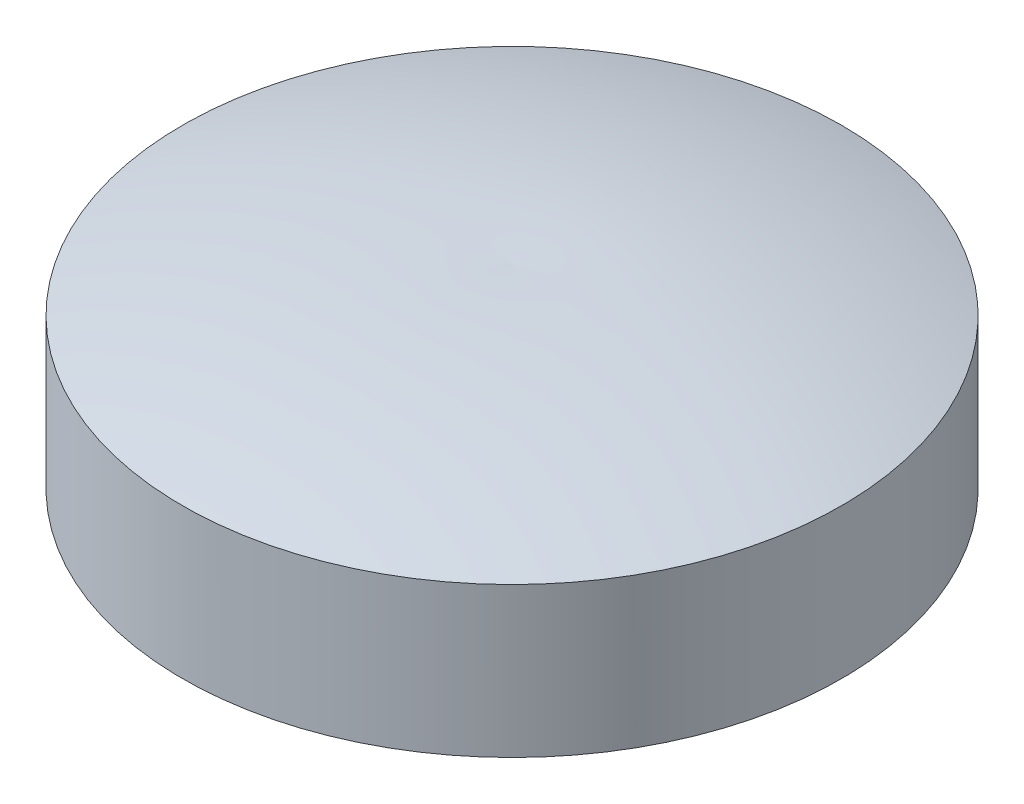
ISO-10303-21;
HEADER;
FILE_DESCRIPTION(('STEP AP214'),'2;1');
FILE_NAME('part.step','',(''),(''),'','','');
FILE_SCHEMA(('AUTOMOTIVE_DESIGN { 1 0 10303 214 1 1 1 1 }'));
ENDSEC;
DATA;
#1=APPLICATION_CONTEXT('core data for automotive mechanical design processes');
#2=APPLICATION_PROTOCOL_DEFINITION('international standard','automotive_design',2000,#1);
#3=PRODUCT_CONTEXT('',#1,'mechanical');
#4=PRODUCT('Part','Part','',(#3));
#5=PRODUCT_RELATED_PRODUCT_CATEGORY('part','',(#4));
#6=PRODUCT_DEFINITION_FORMATION('','',#4);
#7=PRODUCT_DEFINITION_CONTEXT('part definition',#1,'design');
#8=PRODUCT_DEFINITION('design','',#6,#7);
#9=PRODUCT_DEFINITION_SHAPE('','',#8);
#10=(LENGTH_UNIT() NAMED_UNIT(*) SI_UNIT(.MILLI.,.METRE.));
#11=(NAMED_UNIT(*) PLANE_ANGLE_UNIT() SI_UNIT($,.RADIAN.));
#12=(NAMED_UNIT(*) SI_UNIT($,.STERADIAN.) SOLID_ANGLE_UNIT());
#13=UNCERTAINTY_MEASURE_WITH_UNIT(LENGTH_MEASURE(1.E-05),#10,'distance_accuracy_value','');
#14=(GEOMETRIC_REPRESENTATION_CONTEXT(3) GLOBAL_UNCERTAINTY_ASSIGNED_CONTEXT((#13)) GLOBAL_UNIT_ASSIGNED_CONTEXT((#10,
#11,#12)) REPRESENTATION_CONTEXT('',''));
#15=CARTESIAN_POINT('',(0.,0.,0.));
#16=DIRECTION('',(0.,0.,1.));
#17=DIRECTION('',(1.,0.,0.));
#18=AXIS2_PLACEMENT_3D('',#15,#16,#17);
#19=CARTESIAN_POINT('',(-0.0973145456395347,-48.5502540020136,-2.78755191630507));
#20=DIRECTION('',(-1.,0.,0.));
#21=DIRECTION('',(0.,0.,-1.));
#22=AXIS2_PLACEMENT_3D('',#19,#20,#21);
#23=CIRCLE('',#22,61.7875316791346);
#24=TRIMMED_CURVE('',#23,(PARAMETER_VALUE(-1.61592676535047)),
(PARAMETER_VALUE(1.61592676535047)),.T.,.PARAMETER.);
#25=CARTESIAN_POINT('',(-0.0973145456395347,-48.5502540020136,0.));
#26=DIRECTION('',(0.,-1.,0.));
#27=AXIS1_PLACEMENT('',#25,#26);
#28=SURFACE_OF_REVOLUTION('',#24,#27);
#29=CARTESIAN_POINT('',(-0.0973145456395347,13.1743652784158,0.));
#30=VERTEX_POINT('',#29);
#31=VERTEX_LOOP('',#30);
#32=FACE_BOUND('',#31,.T.);
#33=CARTESIAN_POINT('',(-0.0973145456395347,10.1743652784158,0.));
#34=DIRECTION('',(0.,-1.,0.));
#35=DIRECTION('',(0.,0.,-1.));
#36=AXIS2_PLACEMENT_3D('',#33,#34,#35);
#37=CIRCLE('',#36,22.);
#38=CARTESIAN_POINT('',(-0.0973145456395347,10.1743652784158,-22.));
#39=VERTEX_POINT('',#38);
#40=EDGE_CURVE('E13',#39,#39,#37,.T.);
#41=ORIENTED_EDGE('',*,*,#40,.F.);
#42=EDGE_LOOP('',(#41));
#43=FACE_BOUND('',#42,.T.);
#44=ADVANCED_FACE('F44',(#32,#43),#28,.T.);
#45=CARTESIAN_POINT('',(-0.0973145456395347,0.174365278415828,0.));
#46=DIRECTION('',(0.,-1.,0.));
#47=DIRECTION('',(0.,0.,-1.));
#48=AXIS2_PLACEMENT_3D('',#45,#46,#47);
#49=CYLINDRICAL_SURFACE('',#48,22.);
#50=DIRECTION('',(0.,-1.,0.));
#51=VECTOR('',#50,1.);
#52=CARTESIAN_POINT('',(-22.0461781820032,5.17436527841583,-1.49912810403696));
#53=LINE('',#52,#51);
#54=CARTESIAN_POINT('',(-22.0461781820032,5.17436527841583,-1.49912810403696));
#55=VERTEX_POINT('',#54);
#56=CARTESIAN_POINT('',(-22.0461781820032,0.174365278415828,-1.49912810403696));
#57=VERTEX_POINT('',#56);
#58=EDGE_CURVE('E58',#55,#57,#53,.T.);
#59=ORIENTED_EDGE('',*,*,#58,.F.);
#60=CARTESIAN_POINT('',(-0.0973145456395347,5.17436527841583,0.));
#61=DIRECTION('',(0.,-1.,0.));
#62=DIRECTION('',(0.,0.,-1.));
#63=AXIS2_PLACEMENT_3D('',#60,#61,#62);
#64=CIRCLE('',#63,22.);
#65=CARTESIAN_POINT('',(-22.0461781820032,5.17436527841583,1.4991281040373));
#66=VERTEX_POINT('',#65);
#67=EDGE_CURVE('E73',#66,#55,#64,.T.);
#68=ORIENTED_EDGE('',*,*,#67,.F.);
#69=DIRECTION('',(0.,-1.,0.));
#70=VECTOR('',#69,1.);
#71=CARTESIAN_POINT('',(-22.0461781820032,5.17436527841583,1.4991281040373));
#72=LINE('',#71,#70);
#73=CARTESIAN_POINT('',(-22.0461781820032,0.174365278415828,1.4991281040373));
#74=VERTEX_POINT('',#73);
#75=EDGE_CURVE('E81',#66,#74,#72,.T.);
#76=ORIENTED_EDGE('',*,*,#75,.T.);
#77=CARTESIAN_POINT('',(-0.0973145456395347,0.174365278415828,0.));
#78=DIRECTION('',(0.,-1.,0.));
#79=DIRECTION('',(0.,0.,-1.));
#80=AXIS2_PLACEMENT_3D('',#77,#78,#79);
#81=CIRCLE('',#80,22.);
#82=EDGE_CURVE('E51',#57,#74,#81,.T.);
#83=ORIENTED_EDGE('',*,*,#82,.F.);
#84=EDGE_LOOP('',(#59,#68,#76,#83));
#85=FACE_BOUND('',#84,.T.);
#86=ORIENTED_EDGE('',*,*,#40,.T.);
#87=EDGE_LOOP('',(#86));
#88=FACE_BOUND('',#87,.T.);
#89=ADVANCED_FACE('F84',(#85,#88),#49,.T.);
#90=CARTESIAN_POINT('',(-0.0973145456395347,0.174365278415828,0.));
#91=DIRECTION('',(0.,-1.,0.));
#92=DIRECTION('',(0.,0.,-1.));
#93=AXIS2_PLACEMENT_3D('',#90,#91,#92);
#94=PLANE('',#93);
#95=CARTESIAN_POINT('',(-22.0973145456396,0.174365278415828,1.94289029309402E-13));
#96=DIRECTION('',(0.,-1.,0.));
#97=DIRECTION('',(0.,0.,-1.));
#98=AXIS2_PLACEMENT_3D('',#95,#96,#97);
#99=CIRCLE('',#98,1.50000000000001);
#100=EDGE_CURVE('E78',#57,#74,#99,.T.);
#101=ORIENTED_EDGE('',*,*,#100,.F.);
#102=ORIENTED_EDGE('',*,*,#82,.T.);
#103=EDGE_LOOP('',(#101,#102));
#104=FACE_BOUND('',#103,.T.);
#105=ADVANCED_FACE('F91',(#104),#94,.T.);
#106=CARTESIAN_POINT('',(-22.0973145456396,5.17436527841583,1.94289029309402E-13));
#107=DIRECTION('',(0.,-1.,0.));
#108=DIRECTION('',(0.,0.,-1.));
#109=AXIS2_PLACEMENT_3D('',#106,#107,#108);
#110=CYLINDRICAL_SURFACE('',#109,1.50000000000001);
#111=ORIENTED_EDGE('',*,*,#100,.T.);
#112=ORIENTED_EDGE('',*,*,#75,.F.);
#113=CARTESIAN_POINT('',(-22.0973145456396,5.17436527841583,1.94289029309402E-13));
#114=DIRECTION('',(0.,-1.,0.));
#115=DIRECTION('',(0.,0.,-1.));
#116=AXIS2_PLACEMENT_3D('',#113,#114,#115);
#117=CIRCLE('',#116,1.50000000000001);
#118=EDGE_CURVE('E75',#55,#66,#117,.T.);
#119=ORIENTED_EDGE('',*,*,#118,.F.);
#120=ORIENTED_EDGE('',*,*,#58,.T.);
#121=EDGE_LOOP('',(#111,#112,#119,#120));
#122=FACE_BOUND('',#121,.T.);
#123=ADVANCED_FACE('F80',(#122),#110,.F.);
#124=CARTESIAN_POINT('',(-11.0973145456396,5.17436527841583,0.));
#125=DIRECTION('',(0.,-1.,0.));
#126=DIRECTION('',(0.,0.,-1.));
#127=AXIS2_PLACEMENT_3D('',#124,#125,#126);
#128=PLANE('',#127);
#129=ORIENTED_EDGE('',*,*,#67,.T.);
#130=ORIENTED_EDGE('',*,*,#118,.T.);
#131=EDGE_LOOP('',(#129,#130));
#132=FACE_BOUND('',#131,.T.);
#133=ADVANCED_FACE('F74',(#132),#128,.T.);
#134=CLOSED_SHELL('',(#44,#89,#105,#123,#133));
#135=MANIFOLD_SOLID_BREP('B2',#134);
#136=ADVANCED_BREP_SHAPE_REPRESENTATION('',(#18,#135),#14);
#137=SHAPE_DEFINITION_REPRESENTATION(#9,#136);
ENDSEC;
END-ISO-10303-21;
